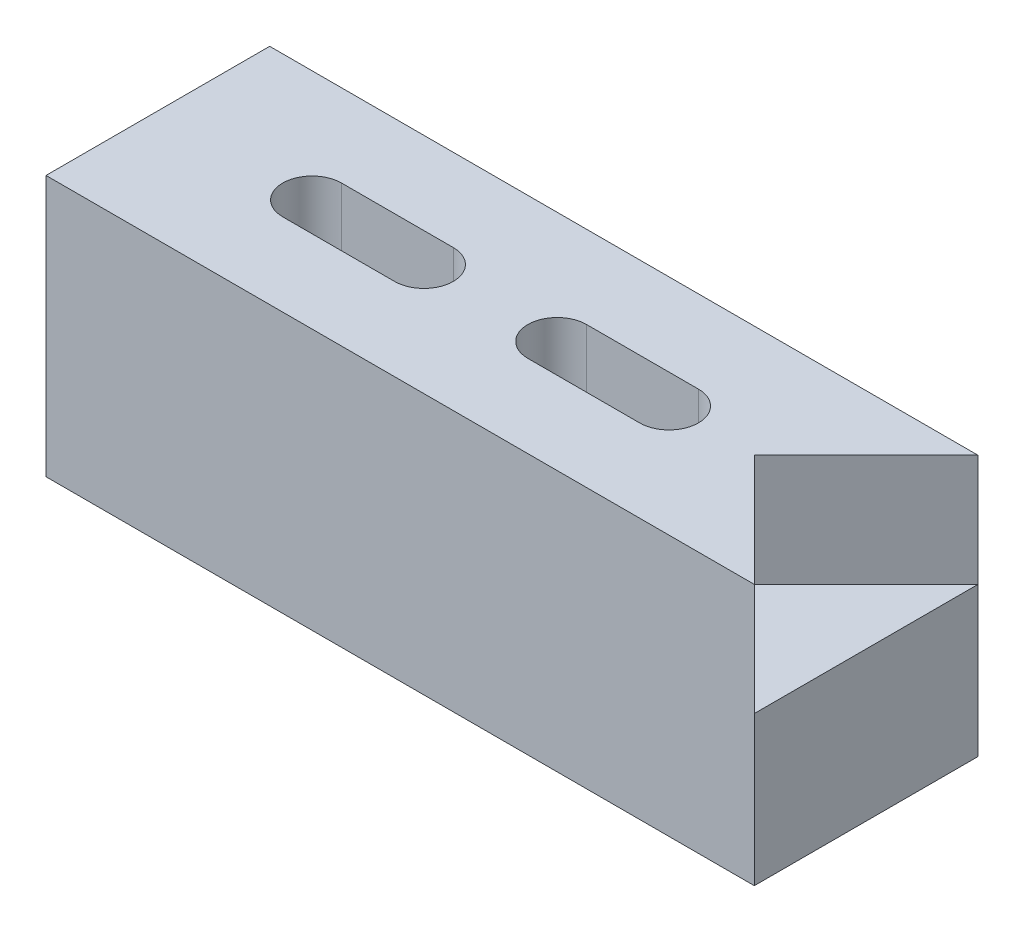
ISO-10303-21;
HEADER;
FILE_DESCRIPTION(('STEP AP214'),'2;1');
FILE_NAME('part.step','',(''),(''),'','','');
FILE_SCHEMA(('AUTOMOTIVE_DESIGN { 1 0 10303 214 1 1 1 1 }'));
ENDSEC;
DATA;
#1=APPLICATION_CONTEXT('core data for automotive mechanical design processes');
#2=APPLICATION_PROTOCOL_DEFINITION('international standard','automotive_design',2000,#1);
#3=PRODUCT_CONTEXT('',#1,'mechanical');
#4=PRODUCT('Part','Part','',(#3));
#5=PRODUCT_RELATED_PRODUCT_CATEGORY('part','',(#4));
#6=PRODUCT_DEFINITION_FORMATION('','',#4);
#7=PRODUCT_DEFINITION_CONTEXT('part definition',#1,'design');
#8=PRODUCT_DEFINITION('design','',#6,#7);
#9=PRODUCT_DEFINITION_SHAPE('','',#8);
#10=(LENGTH_UNIT() NAMED_UNIT(*) SI_UNIT(.MILLI.,.METRE.));
#11=(NAMED_UNIT(*) PLANE_ANGLE_UNIT() SI_UNIT($,.RADIAN.));
#12=(NAMED_UNIT(*) SI_UNIT($,.STERADIAN.) SOLID_ANGLE_UNIT());
#13=UNCERTAINTY_MEASURE_WITH_UNIT(LENGTH_MEASURE(1.E-05),#10,'distance_accuracy_value','');
#14=(GEOMETRIC_REPRESENTATION_CONTEXT(3) GLOBAL_UNCERTAINTY_ASSIGNED_CONTEXT((#13)) GLOBAL_UNIT_ASSIGNED_CONTEXT((#10,
#11,#12)) REPRESENTATION_CONTEXT('',''));
#15=CARTESIAN_POINT('',(0.,0.,0.));
#16=DIRECTION('',(0.,0.,1.));
#17=DIRECTION('',(1.,0.,0.));
#18=AXIS2_PLACEMENT_3D('',#15,#16,#17);
#19=CARTESIAN_POINT('',(48.26,0.,-15.24));
#20=DIRECTION('',(1.,0.,0.));
#21=DIRECTION('',(0.,0.,-1.));
#22=AXIS2_PLACEMENT_3D('',#19,#20,#21);
#23=PLANE('',#22);
#24=DIRECTION('',(0.,1.,0.));
#25=VECTOR('',#24,1.);
#26=CARTESIAN_POINT('',(48.26,0.,-15.24));
#27=LINE('',#26,#25);
#28=CARTESIAN_POINT('',(48.26,0.,-15.24));
#29=VERTEX_POINT('',#28);
#30=CARTESIAN_POINT('',(48.26,10.16,-15.24));
#31=VERTEX_POINT('',#30);
#32=EDGE_CURVE('E232',#29,#31,#27,.T.);
#33=ORIENTED_EDGE('',*,*,#32,.T.);
#34=DIRECTION('',(0.,0.,-1.));
#35=VECTOR('',#34,1.);
#36=CARTESIAN_POINT('',(48.26,10.16,-15.24));
#37=LINE('',#36,#35);
#38=CARTESIAN_POINT('',(48.26,10.16,0.));
#39=VERTEX_POINT('',#38);
#40=EDGE_CURVE('E204',#39,#31,#37,.T.);
#41=ORIENTED_EDGE('',*,*,#40,.F.);
#42=DIRECTION('',(0.,1.,0.));
#43=VECTOR('',#42,1.);
#44=CARTESIAN_POINT('',(48.26,0.,0.));
#45=LINE('',#44,#43);
#46=CARTESIAN_POINT('',(48.26,0.,0.));
#47=VERTEX_POINT('',#46);
#48=EDGE_CURVE('E243',#47,#39,#45,.T.);
#49=ORIENTED_EDGE('',*,*,#48,.F.);
#50=DIRECTION('',(0.,0.,1.));
#51=VECTOR('',#50,1.);
#52=CARTESIAN_POINT('',(48.26,0.,-15.24));
#53=LINE('',#52,#51);
#54=EDGE_CURVE('E41',#29,#47,#53,.T.);
#55=ORIENTED_EDGE('',*,*,#54,.F.);
#56=EDGE_LOOP('',(#33,#41,#49,#55));
#57=FACE_BOUND('',#56,.T.);
#58=ADVANCED_FACE('F32',(#57),#23,.T.);
#59=CARTESIAN_POINT('',(0.,0.,-15.24));
#60=DIRECTION('',(-1.,0.,0.));
#61=DIRECTION('',(0.,0.,1.));
#62=AXIS2_PLACEMENT_3D('',#59,#60,#61);
#63=PLANE('',#62);
#64=DIRECTION('',(0.,-1.,0.));
#65=VECTOR('',#64,1.);
#66=CARTESIAN_POINT('',(0.,0.,0.));
#67=LINE('',#66,#65);
#68=CARTESIAN_POINT('',(0.,17.78,0.));
#69=VERTEX_POINT('',#68);
#70=CARTESIAN_POINT('',(0.,0.,0.));
#71=VERTEX_POINT('',#70);
#72=EDGE_CURVE('E221',#69,#71,#67,.T.);
#73=ORIENTED_EDGE('',*,*,#72,.F.);
#74=DIRECTION('',(0.,0.,1.));
#75=VECTOR('',#74,1.);
#76=CARTESIAN_POINT('',(0.,17.78,-15.24));
#77=LINE('',#76,#75);
#78=CARTESIAN_POINT('',(0.,17.78,-15.24));
#79=VERTEX_POINT('',#78);
#80=EDGE_CURVE('E11',#79,#69,#77,.T.);
#81=ORIENTED_EDGE('',*,*,#80,.F.);
#82=DIRECTION('',(0.,-1.,0.));
#83=VECTOR('',#82,1.);
#84=CARTESIAN_POINT('',(0.,0.,-15.24));
#85=LINE('',#84,#83);
#86=CARTESIAN_POINT('',(0.,0.,-15.24));
#87=VERTEX_POINT('',#86);
#88=EDGE_CURVE('E225',#79,#87,#85,.T.);
#89=ORIENTED_EDGE('',*,*,#88,.T.);
#90=DIRECTION('',(0.,0.,1.));
#91=VECTOR('',#90,1.);
#92=CARTESIAN_POINT('',(0.,0.,-15.24));
#93=LINE('',#92,#91);
#94=EDGE_CURVE('E36',#87,#71,#93,.T.);
#95=ORIENTED_EDGE('',*,*,#94,.T.);
#96=EDGE_LOOP('',(#73,#81,#89,#95));
#97=FACE_BOUND('',#96,.T.);
#98=ADVANCED_FACE('F34',(#97),#63,.T.);
#99=CARTESIAN_POINT('',(0.,17.78,-15.24));
#100=DIRECTION('',(0.,1.,0.));
#101=DIRECTION('',(0.,0.,1.));
#102=AXIS2_PLACEMENT_3D('',#99,#100,#101);
#103=PLANE('',#102);
#104=CARTESIAN_POINT('',(34.83,17.78,-7.62));
#105=DIRECTION('',(0.,1.,0.));
#106=DIRECTION('',(0.,0.,1.));
#107=AXIS2_PLACEMENT_3D('',#104,#105,#106);
#108=CIRCLE('',#107,2.);
#109=CARTESIAN_POINT('',(34.83,17.78,-5.62));
#110=VERTEX_POINT('',#109);
#111=CARTESIAN_POINT('',(34.83,17.78,-9.62));
#112=VERTEX_POINT('',#111);
#113=EDGE_CURVE('E49',#110,#112,#108,.T.);
#114=ORIENTED_EDGE('',*,*,#113,.F.);
#115=DIRECTION('',(1.,0.,0.));
#116=VECTOR('',#115,1.);
#117=CARTESIAN_POINT('',(34.83,17.78,-5.62));
#118=LINE('',#117,#116);
#119=CARTESIAN_POINT('',(27.21,17.78,-5.62));
#120=VERTEX_POINT('',#119);
#121=EDGE_CURVE('E155',#120,#110,#118,.T.);
#122=ORIENTED_EDGE('',*,*,#121,.F.);
#123=CARTESIAN_POINT('',(27.21,17.78,-7.62));
#124=DIRECTION('',(0.,1.,0.));
#125=DIRECTION('',(0.,0.,1.));
#126=AXIS2_PLACEMENT_3D('',#123,#124,#125);
#127=CIRCLE('',#126,2.);
#128=CARTESIAN_POINT('',(27.21,17.78,-9.62));
#129=VERTEX_POINT('',#128);
#130=EDGE_CURVE('E158',#129,#120,#127,.T.);
#131=ORIENTED_EDGE('',*,*,#130,.F.);
#132=DIRECTION('',(-1.,0.,0.));
#133=VECTOR('',#132,1.);
#134=CARTESIAN_POINT('',(34.83,17.78,-9.62));
#135=LINE('',#134,#133);
#136=EDGE_CURVE('E164',#112,#129,#135,.T.);
#137=ORIENTED_EDGE('',*,*,#136,.F.);
#138=EDGE_LOOP('',(#114,#122,#131,#137));
#139=FACE_BOUND('',#138,.T.);
#140=CARTESIAN_POINT('',(18.13,17.78,-7.62));
#141=DIRECTION('',(0.,1.,0.));
#142=DIRECTION('',(0.,0.,1.));
#143=AXIS2_PLACEMENT_3D('',#140,#141,#142);
#144=CIRCLE('',#143,2.);
#145=CARTESIAN_POINT('',(18.13,17.78,-5.62));
#146=VERTEX_POINT('',#145);
#147=CARTESIAN_POINT('',(18.13,17.78,-9.62));
#148=VERTEX_POINT('',#147);
#149=EDGE_CURVE('E57',#146,#148,#144,.T.);
#150=ORIENTED_EDGE('',*,*,#149,.F.);
#151=DIRECTION('',(1.,0.,0.));
#152=VECTOR('',#151,1.);
#153=CARTESIAN_POINT('',(18.13,17.78,-5.62));
#154=LINE('',#153,#152);
#155=CARTESIAN_POINT('',(10.51,17.78,-5.62));
#156=VERTEX_POINT('',#155);
#157=EDGE_CURVE('E179',#156,#146,#154,.T.);
#158=ORIENTED_EDGE('',*,*,#157,.F.);
#159=CARTESIAN_POINT('',(10.51,17.78,-7.62));
#160=DIRECTION('',(0.,1.,0.));
#161=DIRECTION('',(0.,0.,1.));
#162=AXIS2_PLACEMENT_3D('',#159,#160,#161);
#163=CIRCLE('',#162,2.);
#164=CARTESIAN_POINT('',(10.51,17.78,-9.62));
#165=VERTEX_POINT('',#164);
#166=EDGE_CURVE('E193',#165,#156,#163,.T.);
#167=ORIENTED_EDGE('',*,*,#166,.F.);
#168=DIRECTION('',(-1.,0.,0.));
#169=VECTOR('',#168,1.);
#170=CARTESIAN_POINT('',(18.13,17.78,-9.62));
#171=LINE('',#170,#169);
#172=EDGE_CURVE('E190',#148,#165,#171,.T.);
#173=ORIENTED_EDGE('',*,*,#172,.F.);
#174=EDGE_LOOP('',(#150,#158,#167,#173));
#175=FACE_BOUND('',#174,.T.);
#176=DIRECTION('',(0.707106781186549,0.,0.707106781186546));
#177=VECTOR('',#176,1.);
#178=CARTESIAN_POINT('',(40.64,17.78,-7.62));
#179=LINE('',#178,#177);
#180=CARTESIAN_POINT('',(40.64,17.78,-7.62));
#181=VERTEX_POINT('',#180);
#182=CARTESIAN_POINT('',(48.26,17.78,0.));
#183=VERTEX_POINT('',#182);
#184=EDGE_CURVE('E208',#181,#183,#179,.T.);
#185=ORIENTED_EDGE('',*,*,#184,.F.);
#186=DIRECTION('',(-0.707106781186549,0.,0.707106781186546));
#187=VECTOR('',#186,1.);
#188=CARTESIAN_POINT('',(48.26,17.78,-15.24));
#189=LINE('',#188,#187);
#190=CARTESIAN_POINT('',(48.26,17.78,-15.24));
#191=VERTEX_POINT('',#190);
#192=EDGE_CURVE('E171',#191,#181,#189,.T.);
#193=ORIENTED_EDGE('',*,*,#192,.F.);
#194=DIRECTION('',(-1.,0.,0.));
#195=VECTOR('',#194,1.);
#196=CARTESIAN_POINT('',(0.,17.78,-15.24));
#197=LINE('',#196,#195);
#198=EDGE_CURVE('E235',#191,#79,#197,.T.);
#199=ORIENTED_EDGE('',*,*,#198,.T.);
#200=ORIENTED_EDGE('',*,*,#80,.T.);
#201=DIRECTION('',(-1.,0.,0.));
#202=VECTOR('',#201,1.);
#203=CARTESIAN_POINT('',(0.,17.78,0.));
#204=LINE('',#203,#202);
#205=EDGE_CURVE('E229',#183,#69,#204,.T.);
#206=ORIENTED_EDGE('',*,*,#205,.F.);
#207=EDGE_LOOP('',(#185,#193,#199,#200,#206));
#208=FACE_BOUND('',#207,.T.);
#209=ADVANCED_FACE('F259',(#139,#175,#208),#103,.T.);
#210=CARTESIAN_POINT('',(0.,0.,-15.24));
#211=DIRECTION('',(0.,-1.,0.));
#212=DIRECTION('',(0.,0.,-1.));
#213=AXIS2_PLACEMENT_3D('',#210,#211,#212);
#214=PLANE('',#213);
#215=CARTESIAN_POINT('',(34.83,0.,-7.62));
#216=DIRECTION('',(0.,1.,0.));
#217=DIRECTION('',(0.,0.,1.));
#218=AXIS2_PLACEMENT_3D('',#215,#216,#217);
#219=CIRCLE('',#218,2.);
#220=CARTESIAN_POINT('',(34.83,0.,-5.62));
#221=VERTEX_POINT('',#220);
#222=CARTESIAN_POINT('',(34.83,0.,-9.62));
#223=VERTEX_POINT('',#222);
#224=EDGE_CURVE('E136',#221,#223,#219,.T.);
#225=ORIENTED_EDGE('',*,*,#224,.T.);
#226=DIRECTION('',(-1.,0.,0.));
#227=VECTOR('',#226,1.);
#228=CARTESIAN_POINT('',(34.83,0.,-9.62));
#229=LINE('',#228,#227);
#230=CARTESIAN_POINT('',(27.21,0.,-9.62));
#231=VERTEX_POINT('',#230);
#232=EDGE_CURVE('E146',#223,#231,#229,.T.);
#233=ORIENTED_EDGE('',*,*,#232,.T.);
#234=CARTESIAN_POINT('',(27.21,0.,-7.62));
#235=DIRECTION('',(0.,1.,0.));
#236=DIRECTION('',(0.,0.,1.));
#237=AXIS2_PLACEMENT_3D('',#234,#235,#236);
#238=CIRCLE('',#237,2.);
#239=CARTESIAN_POINT('',(27.21,0.,-5.62));
#240=VERTEX_POINT('',#239);
#241=EDGE_CURVE('E150',#231,#240,#238,.T.);
#242=ORIENTED_EDGE('',*,*,#241,.T.);
#243=DIRECTION('',(1.,0.,0.));
#244=VECTOR('',#243,1.);
#245=CARTESIAN_POINT('',(34.83,0.,-5.62));
#246=LINE('',#245,#244);
#247=EDGE_CURVE('E142',#240,#221,#246,.T.);
#248=ORIENTED_EDGE('',*,*,#247,.T.);
#249=EDGE_LOOP('',(#225,#233,#242,#248));
#250=FACE_BOUND('',#249,.T.);
#251=CARTESIAN_POINT('',(18.13,0.,-7.62));
#252=DIRECTION('',(0.,1.,0.));
#253=DIRECTION('',(0.,0.,1.));
#254=AXIS2_PLACEMENT_3D('',#251,#252,#253);
#255=CIRCLE('',#254,2.);
#256=CARTESIAN_POINT('',(18.13,0.,-5.62));
#257=VERTEX_POINT('',#256);
#258=CARTESIAN_POINT('',(18.13,0.,-9.62));
#259=VERTEX_POINT('',#258);
#260=EDGE_CURVE('E175',#257,#259,#255,.T.);
#261=ORIENTED_EDGE('',*,*,#260,.T.);
#262=DIRECTION('',(-1.,0.,0.));
#263=VECTOR('',#262,1.);
#264=CARTESIAN_POINT('',(18.13,0.,-9.62));
#265=LINE('',#264,#263);
#266=CARTESIAN_POINT('',(10.51,0.,-9.62));
#267=VERTEX_POINT('',#266);
#268=EDGE_CURVE('E178',#259,#267,#265,.T.);
#269=ORIENTED_EDGE('',*,*,#268,.T.);
#270=CARTESIAN_POINT('',(10.51,0.,-7.62));
#271=DIRECTION('',(0.,1.,0.));
#272=DIRECTION('',(0.,0.,1.));
#273=AXIS2_PLACEMENT_3D('',#270,#271,#272);
#274=CIRCLE('',#273,2.);
#275=CARTESIAN_POINT('',(10.51,0.,-5.62));
#276=VERTEX_POINT('',#275);
#277=EDGE_CURVE('E182',#267,#276,#274,.T.);
#278=ORIENTED_EDGE('',*,*,#277,.T.);
#279=DIRECTION('',(1.,0.,0.));
#280=VECTOR('',#279,1.);
#281=CARTESIAN_POINT('',(18.13,0.,-5.62));
#282=LINE('',#281,#280);
#283=EDGE_CURVE('E185',#276,#257,#282,.T.);
#284=ORIENTED_EDGE('',*,*,#283,.T.);
#285=EDGE_LOOP('',(#261,#269,#278,#284));
#286=FACE_BOUND('',#285,.T.);
#287=DIRECTION('',(1.,0.,0.));
#288=VECTOR('',#287,1.);
#289=CARTESIAN_POINT('',(0.,0.,0.));
#290=LINE('',#289,#288);
#291=EDGE_CURVE('E240',#71,#47,#290,.T.);
#292=ORIENTED_EDGE('',*,*,#291,.F.);
#293=ORIENTED_EDGE('',*,*,#94,.F.);
#294=DIRECTION('',(1.,0.,0.));
#295=VECTOR('',#294,1.);
#296=CARTESIAN_POINT('',(0.,0.,-15.24));
#297=LINE('',#296,#295);
#298=EDGE_CURVE('E228',#87,#29,#297,.T.);
#299=ORIENTED_EDGE('',*,*,#298,.T.);
#300=ORIENTED_EDGE('',*,*,#54,.T.);
#301=EDGE_LOOP('',(#292,#293,#299,#300));
#302=FACE_BOUND('',#301,.T.);
#303=ADVANCED_FACE('F152',(#250,#286,#302),#214,.T.);
#304=CARTESIAN_POINT('',(0.,0.,-15.24));
#305=DIRECTION('',(0.,0.,-1.));
#306=DIRECTION('',(-1.,0.,0.));
#307=AXIS2_PLACEMENT_3D('',#304,#305,#306);
#308=PLANE('',#307);
#309=ORIENTED_EDGE('',*,*,#88,.F.);
#310=ORIENTED_EDGE('',*,*,#198,.F.);
#311=DIRECTION('',(0.,1.,0.));
#312=VECTOR('',#311,1.);
#313=CARTESIAN_POINT('',(48.26,10.16,-15.24));
#314=LINE('',#313,#312);
#315=EDGE_CURVE('E214',#31,#191,#314,.T.);
#316=ORIENTED_EDGE('',*,*,#315,.F.);
#317=ORIENTED_EDGE('',*,*,#32,.F.);
#318=ORIENTED_EDGE('',*,*,#298,.F.);
#319=EDGE_LOOP('',(#309,#310,#316,#317,#318));
#320=FACE_BOUND('',#319,.T.);
#321=ADVANCED_FACE('F263',(#320),#308,.T.);
#322=CARTESIAN_POINT('',(0.,0.,0.));
#323=DIRECTION('',(0.,0.,-1.));
#324=DIRECTION('',(-1.,0.,0.));
#325=AXIS2_PLACEMENT_3D('',#322,#323,#324);
#326=PLANE('',#325);
#327=ORIENTED_EDGE('',*,*,#72,.T.);
#328=ORIENTED_EDGE('',*,*,#291,.T.);
#329=ORIENTED_EDGE('',*,*,#48,.T.);
#330=DIRECTION('',(0.,1.,0.));
#331=VECTOR('',#330,1.);
#332=CARTESIAN_POINT('',(48.26,10.16,0.));
#333=LINE('',#332,#331);
#334=EDGE_CURVE('E218',#39,#183,#333,.T.);
#335=ORIENTED_EDGE('',*,*,#334,.T.);
#336=ORIENTED_EDGE('',*,*,#205,.T.);
#337=EDGE_LOOP('',(#327,#328,#329,#335,#336));
#338=FACE_BOUND('',#337,.T.);
#339=ADVANCED_FACE('F255',(#338),#326,.F.);
#340=CARTESIAN_POINT('',(40.64,10.16,-7.62));
#341=DIRECTION('',(-0.707106781186546,0.,0.707106781186549));
#342=DIRECTION('',(0.707106781186549,0.,0.707106781186546));
#343=AXIS2_PLACEMENT_3D('',#340,#341,#342);
#344=PLANE('',#343);
#345=ORIENTED_EDGE('',*,*,#184,.T.);
#346=ORIENTED_EDGE('',*,*,#334,.F.);
#347=DIRECTION('',(0.707106781186549,0.,0.707106781186546));
#348=VECTOR('',#347,1.);
#349=CARTESIAN_POINT('',(40.64,10.16,-7.62));
#350=LINE('',#349,#348);
#351=CARTESIAN_POINT('',(40.64,10.16,-7.62));
#352=VERTEX_POINT('',#351);
#353=EDGE_CURVE('E211',#352,#39,#350,.T.);
#354=ORIENTED_EDGE('',*,*,#353,.F.);
#355=DIRECTION('',(0.,1.,0.));
#356=VECTOR('',#355,1.);
#357=CARTESIAN_POINT('',(40.64,10.16,-7.62));
#358=LINE('',#357,#356);
#359=EDGE_CURVE('E222',#352,#181,#358,.T.);
#360=ORIENTED_EDGE('',*,*,#359,.T.);
#361=EDGE_LOOP('',(#345,#346,#354,#360));
#362=FACE_BOUND('',#361,.T.);
#363=ADVANCED_FACE('F272',(#362),#344,.F.);
#364=CARTESIAN_POINT('',(48.26,10.16,-15.24));
#365=DIRECTION('',(-0.707106781186546,0.,-0.707106781186549));
#366=DIRECTION('',(-0.707106781186549,0.,0.707106781186546));
#367=AXIS2_PLACEMENT_3D('',#364,#365,#366);
#368=PLANE('',#367);
#369=ORIENTED_EDGE('',*,*,#192,.T.);
#370=ORIENTED_EDGE('',*,*,#359,.F.);
#371=DIRECTION('',(-0.707106781186549,0.,0.707106781186546));
#372=VECTOR('',#371,1.);
#373=CARTESIAN_POINT('',(48.26,10.16,-15.24));
#374=LINE('',#373,#372);
#375=EDGE_CURVE('E207',#31,#352,#374,.T.);
#376=ORIENTED_EDGE('',*,*,#375,.F.);
#377=ORIENTED_EDGE('',*,*,#315,.T.);
#378=EDGE_LOOP('',(#369,#370,#376,#377));
#379=FACE_BOUND('',#378,.T.);
#380=ADVANCED_FACE('F274',(#379),#368,.F.);
#381=CARTESIAN_POINT('',(0.,10.16,0.));
#382=DIRECTION('',(0.,1.,0.));
#383=DIRECTION('',(0.,0.,1.));
#384=AXIS2_PLACEMENT_3D('',#381,#382,#383);
#385=PLANE('',#384);
#386=ORIENTED_EDGE('',*,*,#40,.T.);
#387=ORIENTED_EDGE('',*,*,#375,.T.);
#388=ORIENTED_EDGE('',*,*,#353,.T.);
#389=EDGE_LOOP('',(#386,#387,#388));
#390=FACE_BOUND('',#389,.T.);
#391=ADVANCED_FACE('F269',(#390),#385,.T.);
#392=CARTESIAN_POINT('',(18.13,0.,-7.62));
#393=DIRECTION('',(0.,1.,0.));
#394=DIRECTION('',(0.,0.,1.));
#395=AXIS2_PLACEMENT_3D('',#392,#393,#394);
#396=CYLINDRICAL_SURFACE('',#395,2.);
#397=ORIENTED_EDGE('',*,*,#149,.T.);
#398=DIRECTION('',(0.,1.,0.));
#399=VECTOR('',#398,1.);
#400=CARTESIAN_POINT('',(18.13,0.,-9.62));
#401=LINE('',#400,#399);
#402=EDGE_CURVE('E188',#259,#148,#401,.T.);
#403=ORIENTED_EDGE('',*,*,#402,.F.);
#404=ORIENTED_EDGE('',*,*,#260,.F.);
#405=DIRECTION('',(0.,1.,0.));
#406=VECTOR('',#405,1.);
#407=CARTESIAN_POINT('',(18.13,0.,-5.62));
#408=LINE('',#407,#406);
#409=EDGE_CURVE('E165',#257,#146,#408,.T.);
#410=ORIENTED_EDGE('',*,*,#409,.T.);
#411=EDGE_LOOP('',(#397,#403,#404,#410));
#412=FACE_BOUND('',#411,.T.);
#413=ADVANCED_FACE('F281',(#412),#396,.F.);
#414=CARTESIAN_POINT('',(18.13,0.,-5.62));
#415=DIRECTION('',(0.,0.,1.));
#416=DIRECTION('',(1.,0.,0.));
#417=AXIS2_PLACEMENT_3D('',#414,#415,#416);
#418=PLANE('',#417);
#419=ORIENTED_EDGE('',*,*,#157,.T.);
#420=ORIENTED_EDGE('',*,*,#409,.F.);
#421=ORIENTED_EDGE('',*,*,#283,.F.);
#422=DIRECTION('',(0.,1.,0.));
#423=VECTOR('',#422,1.);
#424=CARTESIAN_POINT('',(10.51,0.,-5.62));
#425=LINE('',#424,#423);
#426=EDGE_CURVE('E199',#276,#156,#425,.T.);
#427=ORIENTED_EDGE('',*,*,#426,.T.);
#428=EDGE_LOOP('',(#419,#420,#421,#427));
#429=FACE_BOUND('',#428,.T.);
#430=ADVANCED_FACE('F312',(#429),#418,.F.);
#431=CARTESIAN_POINT('',(10.51,0.,-7.62));
#432=DIRECTION('',(0.,1.,0.));
#433=DIRECTION('',(0.,0.,1.));
#434=AXIS2_PLACEMENT_3D('',#431,#432,#433);
#435=CYLINDRICAL_SURFACE('',#434,2.);
#436=ORIENTED_EDGE('',*,*,#166,.T.);
#437=ORIENTED_EDGE('',*,*,#426,.F.);
#438=ORIENTED_EDGE('',*,*,#277,.F.);
#439=DIRECTION('',(0.,1.,0.));
#440=VECTOR('',#439,1.);
#441=CARTESIAN_POINT('',(10.51,0.,-9.62));
#442=LINE('',#441,#440);
#443=EDGE_CURVE('E201',#267,#165,#442,.T.);
#444=ORIENTED_EDGE('',*,*,#443,.T.);
#445=EDGE_LOOP('',(#436,#437,#438,#444));
#446=FACE_BOUND('',#445,.T.);
#447=ADVANCED_FACE('F314',(#446),#435,.F.);
#448=CARTESIAN_POINT('',(18.13,0.,-9.62));
#449=DIRECTION('',(0.,0.,-1.));
#450=DIRECTION('',(-1.,0.,0.));
#451=AXIS2_PLACEMENT_3D('',#448,#449,#450);
#452=PLANE('',#451);
#453=ORIENTED_EDGE('',*,*,#172,.T.);
#454=ORIENTED_EDGE('',*,*,#443,.F.);
#455=ORIENTED_EDGE('',*,*,#268,.F.);
#456=ORIENTED_EDGE('',*,*,#402,.T.);
#457=EDGE_LOOP('',(#453,#454,#455,#456));
#458=FACE_BOUND('',#457,.T.);
#459=ADVANCED_FACE('F307',(#458),#452,.F.);
#460=CARTESIAN_POINT('',(34.83,0.,-7.62));
#461=DIRECTION('',(0.,1.,0.));
#462=DIRECTION('',(0.,0.,1.));
#463=AXIS2_PLACEMENT_3D('',#460,#461,#462);
#464=CYLINDRICAL_SURFACE('',#463,2.);
#465=ORIENTED_EDGE('',*,*,#113,.T.);
#466=DIRECTION('',(0.,1.,0.));
#467=VECTOR('',#466,1.);
#468=CARTESIAN_POINT('',(34.83,0.,-9.62));
#469=LINE('',#468,#467);
#470=EDGE_CURVE('E132',#223,#112,#469,.T.);
#471=ORIENTED_EDGE('',*,*,#470,.F.);
#472=ORIENTED_EDGE('',*,*,#224,.F.);
#473=DIRECTION('',(0.,1.,0.));
#474=VECTOR('',#473,1.);
#475=CARTESIAN_POINT('',(34.83,0.,-5.62));
#476=LINE('',#475,#474);
#477=EDGE_CURVE('E169',#221,#110,#476,.T.);
#478=ORIENTED_EDGE('',*,*,#477,.T.);
#479=EDGE_LOOP('',(#465,#471,#472,#478));
#480=FACE_BOUND('',#479,.T.);
#481=ADVANCED_FACE('F134',(#480),#464,.F.);
#482=CARTESIAN_POINT('',(34.83,0.,-5.62));
#483=DIRECTION('',(0.,0.,1.));
#484=DIRECTION('',(1.,0.,0.));
#485=AXIS2_PLACEMENT_3D('',#482,#483,#484);
#486=PLANE('',#485);
#487=ORIENTED_EDGE('',*,*,#121,.T.);
#488=ORIENTED_EDGE('',*,*,#477,.F.);
#489=ORIENTED_EDGE('',*,*,#247,.F.);
#490=DIRECTION('',(0.,1.,0.));
#491=VECTOR('',#490,1.);
#492=CARTESIAN_POINT('',(27.21,0.,-5.62));
#493=LINE('',#492,#491);
#494=EDGE_CURVE('E172',#240,#120,#493,.T.);
#495=ORIENTED_EDGE('',*,*,#494,.T.);
#496=EDGE_LOOP('',(#487,#488,#489,#495));
#497=FACE_BOUND('',#496,.T.);
#498=ADVANCED_FACE('F353',(#497),#486,.F.);
#499=CARTESIAN_POINT('',(27.21,0.,-7.62));
#500=DIRECTION('',(0.,1.,0.));
#501=DIRECTION('',(0.,0.,1.));
#502=AXIS2_PLACEMENT_3D('',#499,#500,#501);
#503=CYLINDRICAL_SURFACE('',#502,2.);
#504=ORIENTED_EDGE('',*,*,#130,.T.);
#505=ORIENTED_EDGE('',*,*,#494,.F.);
#506=ORIENTED_EDGE('',*,*,#241,.F.);
#507=DIRECTION('',(0.,1.,0.));
#508=VECTOR('',#507,1.);
#509=CARTESIAN_POINT('',(27.21,0.,-9.62));
#510=LINE('',#509,#508);
#511=EDGE_CURVE('E141',#231,#129,#510,.T.);
#512=ORIENTED_EDGE('',*,*,#511,.T.);
#513=EDGE_LOOP('',(#504,#505,#506,#512));
#514=FACE_BOUND('',#513,.T.);
#515=ADVANCED_FACE('F361',(#514),#503,.F.);
#516=CARTESIAN_POINT('',(34.83,0.,-9.62));
#517=DIRECTION('',(0.,0.,-1.));
#518=DIRECTION('',(-1.,0.,0.));
#519=AXIS2_PLACEMENT_3D('',#516,#517,#518);
#520=PLANE('',#519);
#521=ORIENTED_EDGE('',*,*,#136,.T.);
#522=ORIENTED_EDGE('',*,*,#511,.F.);
#523=ORIENTED_EDGE('',*,*,#232,.F.);
#524=ORIENTED_EDGE('',*,*,#470,.T.);
#525=EDGE_LOOP('',(#521,#522,#523,#524));
#526=FACE_BOUND('',#525,.T.);
#527=ADVANCED_FACE('F147',(#526),#520,.F.);
#528=CLOSED_SHELL('',(#58,#98,#209,#303,#321,#339,#363,#380,#391,#413,#430,#447,#459,#481,#498,
#515,#527));
#529=MANIFOLD_SOLID_BREP('B2',#528);
#530=ADVANCED_BREP_SHAPE_REPRESENTATION('',(#18,#529),#14);
#531=SHAPE_DEFINITION_REPRESENTATION(#9,#530);
ENDSEC;
END-ISO-10303-21;
